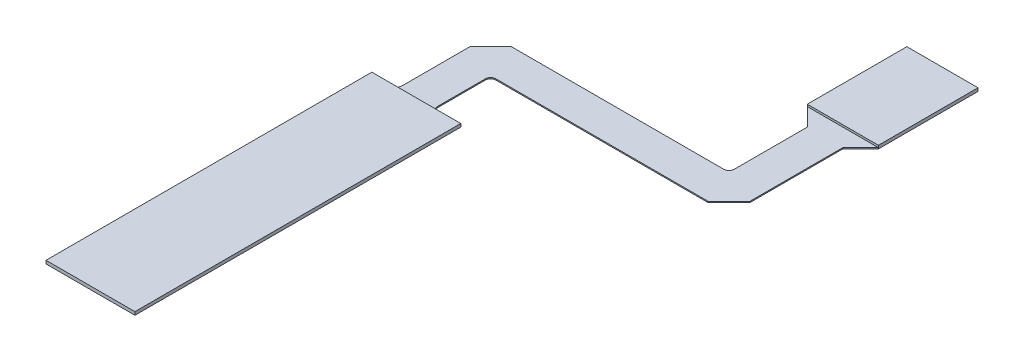
ISO-10303-21;
HEADER;
FILE_DESCRIPTION(('STEP AP214'),'2;1');
FILE_NAME('part.step','',(''),(''),'','','');
FILE_SCHEMA(('AUTOMOTIVE_DESIGN { 1 0 10303 214 1 1 1 1 }'));
ENDSEC;
DATA;
#1=APPLICATION_CONTEXT('core data for automotive mechanical design processes');
#2=APPLICATION_PROTOCOL_DEFINITION('international standard','automotive_design',2000,#1);
#3=PRODUCT_CONTEXT('',#1,'mechanical');
#4=PRODUCT('Part','Part','',(#3));
#5=PRODUCT_RELATED_PRODUCT_CATEGORY('part','',(#4));
#6=PRODUCT_DEFINITION_FORMATION('','',#4);
#7=PRODUCT_DEFINITION_CONTEXT('part definition',#1,'design');
#8=PRODUCT_DEFINITION('design','',#6,#7);
#9=PRODUCT_DEFINITION_SHAPE('','',#8);
#10=(LENGTH_UNIT() NAMED_UNIT(*) SI_UNIT(.MILLI.,.METRE.));
#11=(NAMED_UNIT(*) PLANE_ANGLE_UNIT() SI_UNIT($,.RADIAN.));
#12=(NAMED_UNIT(*) SI_UNIT($,.STERADIAN.) SOLID_ANGLE_UNIT());
#13=UNCERTAINTY_MEASURE_WITH_UNIT(LENGTH_MEASURE(1.E-05),#10,'distance_accuracy_value','');
#14=(GEOMETRIC_REPRESENTATION_CONTEXT(3) GLOBAL_UNCERTAINTY_ASSIGNED_CONTEXT((#13)) GLOBAL_UNIT_ASSIGNED_CONTEXT((#10,
#11,#12)) REPRESENTATION_CONTEXT('',''));
#15=CARTESIAN_POINT('',(0.,0.,0.));
#16=DIRECTION('',(0.,0.,1.));
#17=DIRECTION('',(1.,0.,0.));
#18=AXIS2_PLACEMENT_3D('',#15,#16,#17);
#19=CARTESIAN_POINT('',(4.50000000000001,-0.32,-217.13));
#20=DIRECTION('',(0.,0.,1.));
#21=DIRECTION('',(1.,0.,0.));
#22=AXIS2_PLACEMENT_3D('',#19,#20,#21);
#23=PLANE('',#22);
#24=DIRECTION('',(1.,0.,0.));
#25=VECTOR('',#24,1.);
#26=CARTESIAN_POINT('',(4.50000000000001,-0.32,-217.13));
#27=LINE('',#26,#25);
#28=CARTESIAN_POINT('',(6.,-0.32,-217.13));
#29=VERTEX_POINT('',#28);
#30=CARTESIAN_POINT('',(65.6421356237309,-0.320000000000015,-217.13));
#31=VERTEX_POINT('',#30);
#32=EDGE_CURVE('E62',#29,#31,#27,.T.);
#33=ORIENTED_EDGE('',*,*,#32,.T.);
#34=DIRECTION('',(0.,1.,0.));
#35=VECTOR('',#34,1.);
#36=CARTESIAN_POINT('',(65.6421356237309,-0.320000000000015,-217.13));
#37=LINE('',#36,#35);
#38=CARTESIAN_POINT('',(65.6421356237309,0.,-217.13));
#39=VERTEX_POINT('',#38);
#40=EDGE_CURVE('E259',#31,#39,#37,.T.);
#41=ORIENTED_EDGE('',*,*,#40,.T.);
#42=DIRECTION('',(1.,0.,0.));
#43=VECTOR('',#42,1.);
#44=CARTESIAN_POINT('',(4.50000000000001,0.,-217.13));
#45=LINE('',#44,#43);
#46=CARTESIAN_POINT('',(6.,0.,-217.13));
#47=VERTEX_POINT('',#46);
#48=EDGE_CURVE('E261',#47,#39,#45,.T.);
#49=ORIENTED_EDGE('',*,*,#48,.F.);
#50=DIRECTION('',(0.,1.,0.));
#51=VECTOR('',#50,1.);
#52=CARTESIAN_POINT('',(6.,-0.32,-217.13));
#53=LINE('',#52,#51);
#54=EDGE_CURVE('E222',#47,#29,#53,.F.);
#55=ORIENTED_EDGE('',*,*,#54,.T.);
#56=EDGE_LOOP('',(#33,#41,#49,#55));
#57=FACE_BOUND('',#56,.T.);
#58=ADVANCED_FACE('F53',(#57),#23,.T.);
#59=CARTESIAN_POINT('',(61.5,-0.320000000000001,-227.13));
#60=DIRECTION('',(0.,0.,-1.));
#61=DIRECTION('',(-1.,0.,0.));
#62=AXIS2_PLACEMENT_3D('',#59,#60,#61);
#63=PLANE('',#62);
#64=DIRECTION('',(-1.,0.,0.));
#65=VECTOR('',#64,1.);
#66=CARTESIAN_POINT('',(61.5,0.,-227.13));
#67=LINE('',#66,#65);
#68=CARTESIAN_POINT('',(60.,0.,-227.13));
#69=VERTEX_POINT('',#68);
#70=CARTESIAN_POINT('',(0.357864376269008,0.,-227.13));
#71=VERTEX_POINT('',#70);
#72=EDGE_CURVE('E344',#69,#71,#67,.T.);
#73=ORIENTED_EDGE('',*,*,#72,.F.);
#74=DIRECTION('',(0.,1.,0.));
#75=VECTOR('',#74,1.);
#76=CARTESIAN_POINT('',(60.,-0.319999999999997,-227.13));
#77=LINE('',#76,#75);
#78=CARTESIAN_POINT('',(60.,-0.319999999999997,-227.13));
#79=VERTEX_POINT('',#78);
#80=EDGE_CURVE('E280',#69,#79,#77,.F.);
#81=ORIENTED_EDGE('',*,*,#80,.T.);
#82=DIRECTION('',(-1.,0.,0.));
#83=VECTOR('',#82,1.);
#84=CARTESIAN_POINT('',(61.5,-0.320000000000001,-227.13));
#85=LINE('',#84,#83);
#86=CARTESIAN_POINT('',(0.357864376269015,-0.32,-227.13));
#87=VERTEX_POINT('',#86);
#88=EDGE_CURVE('E13',#79,#87,#85,.T.);
#89=ORIENTED_EDGE('',*,*,#88,.T.);
#90=DIRECTION('',(0.,1.,0.));
#91=VECTOR('',#90,1.);
#92=CARTESIAN_POINT('',(0.357864376269015,0.,-227.13));
#93=LINE('',#92,#91);
#94=EDGE_CURVE('E219',#71,#87,#93,.F.);
#95=ORIENTED_EDGE('',*,*,#94,.F.);
#96=EDGE_LOOP('',(#73,#81,#89,#95));
#97=FACE_BOUND('',#96,.T.);
#98=ADVANCED_FACE('F386',(#97),#63,.T.);
#99=CARTESIAN_POINT('',(-12.5,0.,-109.13));
#100=DIRECTION('',(0.,1.,0.));
#101=DIRECTION('',(0.,0.,1.));
#102=AXIS2_PLACEMENT_3D('',#99,#100,#101);
#103=PLANE('',#102);
#104=ORIENTED_EDGE('',*,*,#48,.T.);
#105=DIRECTION('',(0.707106781186548,0.,-0.707106781186547));
#106=VECTOR('',#105,1.);
#107=CARTESIAN_POINT('',(65.6421356237309,0.,-217.13));
#108=LINE('',#107,#106);
#109=CARTESIAN_POINT('',(71.5,0.,-222.987864376269));
#110=VERTEX_POINT('',#109);
#111=EDGE_CURVE('E265',#39,#110,#108,.T.);
#112=ORIENTED_EDGE('',*,*,#111,.T.);
#113=DIRECTION('',(0.,0.,-1.));
#114=VECTOR('',#113,1.);
#115=CARTESIAN_POINT('',(71.5,0.,-222.987864376269));
#116=LINE('',#115,#114);
#117=CARTESIAN_POINT('',(71.5,0.,-249.13));
#118=VERTEX_POINT('',#117);
#119=EDGE_CURVE('E262',#110,#118,#116,.T.);
#120=ORIENTED_EDGE('',*,*,#119,.T.);
#121=DIRECTION('',(0.707106781186549,0.,-0.707106781186546));
#122=VECTOR('',#121,1.);
#123=CARTESIAN_POINT('',(76.5,0.,-254.13));
#124=LINE('',#123,#122);
#125=CARTESIAN_POINT('',(76.5,0.,-254.13));
#126=VERTEX_POINT('',#125);
#127=EDGE_CURVE('E277',#118,#126,#124,.T.);
#128=ORIENTED_EDGE('',*,*,#127,.T.);
#129=DIRECTION('',(1.,0.,0.));
#130=VECTOR('',#129,1.);
#131=CARTESIAN_POINT('',(76.5,0.,-254.13));
#132=LINE('',#131,#130);
#133=CARTESIAN_POINT('',(56.5,0.,-254.13));
#134=VERTEX_POINT('',#133);
#135=EDGE_CURVE('E328',#134,#126,#132,.T.);
#136=ORIENTED_EDGE('',*,*,#135,.F.);
#137=DIRECTION('',(0.707106781186549,0.,0.707106781186546));
#138=VECTOR('',#137,1.);
#139=CARTESIAN_POINT('',(61.5,0.,-249.13));
#140=LINE('',#139,#138);
#141=CARTESIAN_POINT('',(61.5,0.,-249.13));
#142=VERTEX_POINT('',#141);
#143=EDGE_CURVE('E274',#134,#142,#140,.T.);
#144=ORIENTED_EDGE('',*,*,#143,.T.);
#145=DIRECTION('',(0.,0.,1.));
#146=VECTOR('',#145,1.);
#147=CARTESIAN_POINT('',(61.5,0.,-249.13));
#148=LINE('',#147,#146);
#149=CARTESIAN_POINT('',(61.5,0.,-228.63));
#150=VERTEX_POINT('',#149);
#151=EDGE_CURVE('E271',#142,#150,#148,.T.);
#152=ORIENTED_EDGE('',*,*,#151,.T.);
#153=CARTESIAN_POINT('',(60.,0.,-228.63));
#154=DIRECTION('',(0.,1.,0.));
#155=DIRECTION('',(0.,0.,1.));
#156=AXIS2_PLACEMENT_3D('',#153,#154,#155);
#157=CIRCLE('',#156,1.5);
#158=EDGE_CURVE('E268',#150,#69,#157,.F.);
#159=ORIENTED_EDGE('',*,*,#158,.T.);
#160=ORIENTED_EDGE('',*,*,#72,.T.);
#161=DIRECTION('',(0.707106781186543,0.,-0.707106781186552));
#162=VECTOR('',#161,1.);
#163=CARTESIAN_POINT('',(0.357864376269015,0.,-227.13));
#164=LINE('',#163,#162);
#165=CARTESIAN_POINT('',(-5.5,0.,-221.272135623731));
#166=VERTEX_POINT('',#165);
#167=EDGE_CURVE('E245',#166,#71,#164,.T.);
#168=ORIENTED_EDGE('',*,*,#167,.F.);
#169=DIRECTION('',(0.,0.,1.));
#170=VECTOR('',#169,1.);
#171=CARTESIAN_POINT('',(-5.5,0.,-227.13));
#172=LINE('',#171,#170);
#173=CARTESIAN_POINT('',(-5.49999999999999,0.,-202.23));
#174=VERTEX_POINT('',#173);
#175=EDGE_CURVE('E231',#166,#174,#172,.T.);
#176=ORIENTED_EDGE('',*,*,#175,.T.);
#177=CARTESIAN_POINT('',(-6.99999999999999,0.,-202.23));
#178=DIRECTION('',(0.,1.,0.));
#179=DIRECTION('',(0.,0.,1.));
#180=AXIS2_PLACEMENT_3D('',#177,#178,#179);
#181=CIRCLE('',#180,1.5);
#182=CARTESIAN_POINT('',(-6.99999999999999,0.,-200.73));
#183=VERTEX_POINT('',#182);
#184=EDGE_CURVE('E795',#174,#183,#181,.F.);
#185=ORIENTED_EDGE('',*,*,#184,.T.);
#186=DIRECTION('',(1.,0.,0.));
#187=VECTOR('',#186,1.);
#188=CARTESIAN_POINT('',(-12.5,0.,-200.73));
#189=LINE('',#188,#187);
#190=CARTESIAN_POINT('',(5.99999999999999,0.,-200.73));
#191=VERTEX_POINT('',#190);
#192=EDGE_CURVE('E793',#183,#191,#189,.T.);
#193=ORIENTED_EDGE('',*,*,#192,.T.);
#194=CARTESIAN_POINT('',(5.99999999999999,0.,-202.23));
#195=DIRECTION('',(0.,1.,0.));
#196=DIRECTION('',(0.,0.,1.));
#197=AXIS2_PLACEMENT_3D('',#194,#195,#196);
#198=CIRCLE('',#197,1.5);
#199=CARTESIAN_POINT('',(4.5,0.,-202.23));
#200=VERTEX_POINT('',#199);
#201=EDGE_CURVE('E791',#191,#200,#198,.F.);
#202=ORIENTED_EDGE('',*,*,#201,.T.);
#203=DIRECTION('',(0.,0.,-1.));
#204=VECTOR('',#203,1.);
#205=CARTESIAN_POINT('',(4.5,0.,-200.73));
#206=LINE('',#205,#204);
#207=CARTESIAN_POINT('',(4.5,0.,-215.63));
#208=VERTEX_POINT('',#207);
#209=EDGE_CURVE('E801',#200,#208,#206,.T.);
#210=ORIENTED_EDGE('',*,*,#209,.T.);
#211=CARTESIAN_POINT('',(6.,0.,-215.63));
#212=DIRECTION('',(0.,1.,0.));
#213=DIRECTION('',(0.,0.,1.));
#214=AXIS2_PLACEMENT_3D('',#211,#212,#213);
#215=CIRCLE('',#214,1.5);
#216=EDGE_CURVE('E350',#208,#47,#215,.F.);
#217=ORIENTED_EDGE('',*,*,#216,.T.);
#218=EDGE_LOOP('',(#104,#112,#120,#128,#136,#144,#152,#159,#160,#168,#176,#185,#193,#202,#210,#217));
#219=FACE_BOUND('',#218,.T.);
#220=ADVANCED_FACE('F347',(#219),#103,.T.);
#221=CARTESIAN_POINT('',(-12.5,-0.32,-109.13));
#222=DIRECTION('',(0.,1.,0.));
#223=DIRECTION('',(0.,0.,1.));
#224=AXIS2_PLACEMENT_3D('',#221,#222,#223);
#225=PLANE('',#224);
#226=ORIENTED_EDGE('',*,*,#88,.F.);
#227=CARTESIAN_POINT('',(60.,-0.319999999999997,-228.63));
#228=DIRECTION('',(0.,1.,0.));
#229=DIRECTION('',(0.,0.,1.));
#230=AXIS2_PLACEMENT_3D('',#227,#228,#229);
#231=CIRCLE('',#230,1.5);
#232=CARTESIAN_POINT('',(61.5,-0.320000000000004,-228.63));
#233=VERTEX_POINT('',#232);
#234=EDGE_CURVE('E282',#79,#233,#231,.T.);
#235=ORIENTED_EDGE('',*,*,#234,.T.);
#236=DIRECTION('',(0.,0.,1.));
#237=VECTOR('',#236,1.);
#238=CARTESIAN_POINT('',(61.5,-0.320000000000006,-249.13));
#239=LINE('',#238,#237);
#240=CARTESIAN_POINT('',(61.5,-0.320000000000006,-249.13));
#241=VERTEX_POINT('',#240);
#242=EDGE_CURVE('E287',#241,#233,#239,.T.);
#243=ORIENTED_EDGE('',*,*,#242,.F.);
#244=DIRECTION('',(0.707106781186549,0.,0.707106781186546));
#245=VECTOR('',#244,1.);
#246=CARTESIAN_POINT('',(61.5,-0.320000000000006,-249.13));
#247=LINE('',#246,#245);
#248=CARTESIAN_POINT('',(56.5,-0.320000000000004,-254.13));
#249=VERTEX_POINT('',#248);
#250=EDGE_CURVE('E293',#249,#241,#247,.T.);
#251=ORIENTED_EDGE('',*,*,#250,.F.);
#252=DIRECTION('',(0.,0.,1.));
#253=VECTOR('',#252,1.);
#254=CARTESIAN_POINT('',(56.5,-0.320000000000004,-254.13));
#255=LINE('',#254,#253);
#256=CARTESIAN_POINT('',(56.5,-0.320000000000009,-282.13));
#257=VERTEX_POINT('',#256);
#258=EDGE_CURVE('E296',#257,#249,#255,.T.);
#259=ORIENTED_EDGE('',*,*,#258,.F.);
#260=DIRECTION('',(-1.,0.,0.));
#261=VECTOR('',#260,1.);
#262=CARTESIAN_POINT('',(56.5,-0.320000000000009,-282.13));
#263=LINE('',#262,#261);
#264=CARTESIAN_POINT('',(76.5,-0.320000000000005,-282.13));
#265=VERTEX_POINT('',#264);
#266=EDGE_CURVE('E302',#265,#257,#263,.T.);
#267=ORIENTED_EDGE('',*,*,#266,.F.);
#268=DIRECTION('',(0.,0.,-1.));
#269=VECTOR('',#268,1.);
#270=CARTESIAN_POINT('',(76.5,-0.320000000000005,-282.13));
#271=LINE('',#270,#269);
#272=CARTESIAN_POINT('',(76.5,-0.320000000000004,-254.13));
#273=VERTEX_POINT('',#272);
#274=EDGE_CURVE('E307',#273,#265,#271,.T.);
#275=ORIENTED_EDGE('',*,*,#274,.F.);
#276=DIRECTION('',(0.707106781186549,0.,-0.707106781186546));
#277=VECTOR('',#276,1.);
#278=CARTESIAN_POINT('',(76.5,-0.320000000000004,-254.13));
#279=LINE('',#278,#277);
#280=CARTESIAN_POINT('',(71.5,-0.320000000000016,-249.13));
#281=VERTEX_POINT('',#280);
#282=EDGE_CURVE('E316',#281,#273,#279,.T.);
#283=ORIENTED_EDGE('',*,*,#282,.F.);
#284=DIRECTION('',(0.,0.,-1.));
#285=VECTOR('',#284,1.);
#286=CARTESIAN_POINT('',(71.5,-0.320000000000016,-222.987864376269));
#287=LINE('',#286,#285);
#288=CARTESIAN_POINT('',(71.5,-0.320000000000016,-222.987864376269));
#289=VERTEX_POINT('',#288);
#290=EDGE_CURVE('E321',#289,#281,#287,.T.);
#291=ORIENTED_EDGE('',*,*,#290,.F.);
#292=DIRECTION('',(0.707106781186548,0.,-0.707106781186547));
#293=VECTOR('',#292,1.);
#294=CARTESIAN_POINT('',(65.6421356237309,-0.320000000000015,-217.13));
#295=LINE('',#294,#293);
#296=EDGE_CURVE('E325',#31,#289,#295,.T.);
#297=ORIENTED_EDGE('',*,*,#296,.F.);
#298=ORIENTED_EDGE('',*,*,#32,.F.);
#299=CARTESIAN_POINT('',(6.,-0.32,-215.63));
#300=DIRECTION('',(0.,1.,0.));
#301=DIRECTION('',(0.,0.,1.));
#302=AXIS2_PLACEMENT_3D('',#299,#300,#301);
#303=CIRCLE('',#302,1.5);
#304=CARTESIAN_POINT('',(4.5,-0.32,-215.63));
#305=VERTEX_POINT('',#304);
#306=EDGE_CURVE('E733',#29,#305,#303,.T.);
#307=ORIENTED_EDGE('',*,*,#306,.T.);
#308=DIRECTION('',(0.,0.,-1.));
#309=VECTOR('',#308,1.);
#310=CARTESIAN_POINT('',(4.5,-0.32,-200.73));
#311=LINE('',#310,#309);
#312=CARTESIAN_POINT('',(4.5,-0.32,-202.23));
#313=VERTEX_POINT('',#312);
#314=EDGE_CURVE('E746',#313,#305,#311,.T.);
#315=ORIENTED_EDGE('',*,*,#314,.F.);
#316=CARTESIAN_POINT('',(5.99999999999999,-0.32,-202.23));
#317=DIRECTION('',(0.,1.,0.));
#318=DIRECTION('',(0.,0.,1.));
#319=AXIS2_PLACEMENT_3D('',#316,#317,#318);
#320=CIRCLE('',#319,1.5);
#321=CARTESIAN_POINT('',(5.99999999999999,-0.32,-200.73));
#322=VERTEX_POINT('',#321);
#323=EDGE_CURVE('E738',#313,#322,#320,.T.);
#324=ORIENTED_EDGE('',*,*,#323,.T.);
#325=DIRECTION('',(-1.,0.,0.));
#326=VECTOR('',#325,1.);
#327=CARTESIAN_POINT('',(-12.5,-0.32,-200.73));
#328=LINE('',#327,#326);
#329=CARTESIAN_POINT('',(12.5,-0.32,-200.73));
#330=VERTEX_POINT('',#329);
#331=EDGE_CURVE('E758',#330,#322,#328,.T.);
#332=ORIENTED_EDGE('',*,*,#331,.F.);
#333=DIRECTION('',(0.,0.,-1.));
#334=VECTOR('',#333,1.);
#335=CARTESIAN_POINT('',(12.5,-0.32,-200.73));
#336=LINE('',#335,#334);
#337=CARTESIAN_POINT('',(12.5,-0.32,-109.13));
#338=VERTEX_POINT('',#337);
#339=EDGE_CURVE('E764',#338,#330,#336,.T.);
#340=ORIENTED_EDGE('',*,*,#339,.F.);
#341=DIRECTION('',(1.,0.,0.));
#342=VECTOR('',#341,1.);
#343=CARTESIAN_POINT('',(-12.5,-0.32,-109.13));
#344=LINE('',#343,#342);
#345=CARTESIAN_POINT('',(-12.5,-0.32,-109.13));
#346=VERTEX_POINT('',#345);
#347=EDGE_CURVE('E769',#346,#338,#344,.T.);
#348=ORIENTED_EDGE('',*,*,#347,.F.);
#349=DIRECTION('',(0.,0.,1.));
#350=VECTOR('',#349,1.);
#351=CARTESIAN_POINT('',(-12.5,-0.32,-200.73));
#352=LINE('',#351,#350);
#353=CARTESIAN_POINT('',(-12.5,-0.32,-200.73));
#354=VERTEX_POINT('',#353);
#355=EDGE_CURVE('E774',#354,#346,#352,.T.);
#356=ORIENTED_EDGE('',*,*,#355,.F.);
#357=CARTESIAN_POINT('',(-6.99999999999999,-0.32,-200.73));
#358=VERTEX_POINT('',#357);
#359=EDGE_CURVE('E748',#358,#354,#328,.T.);
#360=ORIENTED_EDGE('',*,*,#359,.F.);
#361=CARTESIAN_POINT('',(-6.99999999999999,-0.32,-202.23));
#362=DIRECTION('',(0.,1.,0.));
#363=DIRECTION('',(0.,0.,1.));
#364=AXIS2_PLACEMENT_3D('',#361,#362,#363);
#365=CIRCLE('',#364,1.5);
#366=CARTESIAN_POINT('',(-5.49999999999999,-0.32,-202.23));
#367=VERTEX_POINT('',#366);
#368=EDGE_CURVE('E223',#358,#367,#365,.T.);
#369=ORIENTED_EDGE('',*,*,#368,.T.);
#370=DIRECTION('',(0.,0.,1.));
#371=VECTOR('',#370,1.);
#372=CARTESIAN_POINT('',(-5.5,-0.32,-227.13));
#373=LINE('',#372,#371);
#374=CARTESIAN_POINT('',(-5.5,-0.32,-221.272135623731));
#375=VERTEX_POINT('',#374);
#376=EDGE_CURVE('E229',#375,#367,#373,.T.);
#377=ORIENTED_EDGE('',*,*,#376,.F.);
#378=DIRECTION('',(0.707106781186543,0.,-0.707106781186552));
#379=VECTOR('',#378,1.);
#380=CARTESIAN_POINT('',(0.357864376269015,-0.32,-227.13));
#381=LINE('',#380,#379);
#382=EDGE_CURVE('E217',#375,#87,#381,.T.);
#383=ORIENTED_EDGE('',*,*,#382,.T.);
#384=EDGE_LOOP('',(#226,#235,#243,#251,#259,#267,#275,#283,#291,#297,#298,#307,#315,#324,#332,
#340,#348,#356,#360,#369,#377,#383));
#385=FACE_BOUND('',#384,.T.);
#386=ADVANCED_FACE('F55',(#385),#225,.F.);
#387=CARTESIAN_POINT('',(-12.5,0.579999999999992,-109.13));
#388=DIRECTION('',(0.,1.,0.));
#389=DIRECTION('',(0.,0.,1.));
#390=AXIS2_PLACEMENT_3D('',#387,#388,#389);
#391=PLANE('',#390);
#392=DIRECTION('',(1.,0.,0.));
#393=VECTOR('',#392,1.);
#394=CARTESIAN_POINT('',(76.5,0.579999999999987,-254.13));
#395=LINE('',#394,#393);
#396=CARTESIAN_POINT('',(56.5,0.579999999999994,-254.13));
#397=VERTEX_POINT('',#396);
#398=CARTESIAN_POINT('',(76.5,0.579999999999987,-254.13));
#399=VERTEX_POINT('',#398);
#400=EDGE_CURVE('E340',#397,#399,#395,.T.);
#401=ORIENTED_EDGE('',*,*,#400,.T.);
#402=DIRECTION('',(0.,0.,-1.));
#403=VECTOR('',#402,1.);
#404=CARTESIAN_POINT('',(76.5,0.579999999999987,-254.13));
#405=LINE('',#404,#403);
#406=CARTESIAN_POINT('',(76.5,0.579999999999986,-282.13));
#407=VERTEX_POINT('',#406);
#408=EDGE_CURVE('E337',#399,#407,#405,.T.);
#409=ORIENTED_EDGE('',*,*,#408,.T.);
#410=DIRECTION('',(-1.,0.,0.));
#411=VECTOR('',#410,1.);
#412=CARTESIAN_POINT('',(76.5,0.579999999999986,-282.13));
#413=LINE('',#412,#411);
#414=CARTESIAN_POINT('',(56.5,0.579999999999996,-282.13));
#415=VERTEX_POINT('',#414);
#416=EDGE_CURVE('E334',#407,#415,#413,.T.);
#417=ORIENTED_EDGE('',*,*,#416,.T.);
#418=DIRECTION('',(0.,0.,1.));
#419=VECTOR('',#418,1.);
#420=CARTESIAN_POINT('',(56.5,0.579999999999997,-254.13));
#421=LINE('',#420,#419);
#422=EDGE_CURVE('E331',#415,#397,#421,.T.);
#423=ORIENTED_EDGE('',*,*,#422,.T.);
#424=EDGE_LOOP('',(#401,#409,#417,#423));
#425=FACE_BOUND('',#424,.T.);
#426=ADVANCED_FACE('F375',(#425),#391,.T.);
#427=CARTESIAN_POINT('',(76.5,35.8893010681705,-254.13));
#428=DIRECTION('',(0.,0.,-1.));
#429=DIRECTION('',(-0.484809620246332,-0.874619707139399,0.));
#430=AXIS2_PLACEMENT_3D('',#427,#428,#429);
#431=PLANE('',#430);
#432=ORIENTED_EDGE('',*,*,#400,.F.);
#433=DIRECTION('',(0.,-1.,0.));
#434=VECTOR('',#433,1.);
#435=CARTESIAN_POINT('',(56.5,35.8893010681705,-254.13));
#436=LINE('',#435,#434);
#437=EDGE_CURVE('E139',#397,#134,#436,.T.);
#438=ORIENTED_EDGE('',*,*,#437,.T.);
#439=ORIENTED_EDGE('',*,*,#135,.T.);
#440=DIRECTION('',(0.,-1.,0.));
#441=VECTOR('',#440,1.);
#442=CARTESIAN_POINT('',(76.5,35.8893010681705,-254.13));
#443=LINE('',#442,#441);
#444=EDGE_CURVE('E135',#399,#126,#443,.T.);
#445=ORIENTED_EDGE('',*,*,#444,.F.);
#446=EDGE_LOOP('',(#432,#438,#439,#445));
#447=FACE_BOUND('',#446,.T.);
#448=ADVANCED_FACE('F376',(#447),#431,.F.);
#449=CARTESIAN_POINT('',(65.6421356237309,-0.320000000000015,-217.13));
#450=DIRECTION('',(0.707106781186548,0.,0.707106781186547));
#451=DIRECTION('',(0.707106781186548,0.,-0.707106781186548));
#452=AXIS2_PLACEMENT_3D('',#449,#450,#451);
#453=PLANE('',#452);
#454=ORIENTED_EDGE('',*,*,#111,.F.);
#455=ORIENTED_EDGE('',*,*,#40,.F.);
#456=ORIENTED_EDGE('',*,*,#296,.T.);
#457=DIRECTION('',(0.,1.,0.));
#458=VECTOR('',#457,1.);
#459=CARTESIAN_POINT('',(71.5,-0.320000000000016,-222.987864376269));
#460=LINE('',#459,#458);
#461=EDGE_CURVE('E323',#289,#110,#460,.T.);
#462=ORIENTED_EDGE('',*,*,#461,.T.);
#463=EDGE_LOOP('',(#454,#455,#456,#462));
#464=FACE_BOUND('',#463,.T.);
#465=ADVANCED_FACE('F354',(#464),#453,.T.);
#466=CARTESIAN_POINT('',(71.5,-0.320000000000016,-222.987864376269));
#467=DIRECTION('',(1.,0.,0.));
#468=DIRECTION('',(0.,0.,-1.));
#469=AXIS2_PLACEMENT_3D('',#466,#467,#468);
#470=PLANE('',#469);
#471=ORIENTED_EDGE('',*,*,#119,.F.);
#472=ORIENTED_EDGE('',*,*,#461,.F.);
#473=ORIENTED_EDGE('',*,*,#290,.T.);
#474=DIRECTION('',(0.,1.,0.));
#475=VECTOR('',#474,1.);
#476=CARTESIAN_POINT('',(71.5,-0.320000000000016,-249.13));
#477=LINE('',#476,#475);
#478=EDGE_CURVE('E319',#281,#118,#477,.T.);
#479=ORIENTED_EDGE('',*,*,#478,.T.);
#480=EDGE_LOOP('',(#471,#472,#473,#479));
#481=FACE_BOUND('',#480,.T.);
#482=ADVANCED_FACE('F358',(#481),#470,.T.);
#483=CARTESIAN_POINT('',(76.5,-0.320000000000004,-254.13));
#484=DIRECTION('',(0.707106781186546,0.,0.707106781186549));
#485=DIRECTION('',(0.707106781186549,0.,-0.707106781186546));
#486=AXIS2_PLACEMENT_3D('',#483,#484,#485);
#487=PLANE('',#486);
#488=ORIENTED_EDGE('',*,*,#127,.F.);
#489=ORIENTED_EDGE('',*,*,#478,.F.);
#490=ORIENTED_EDGE('',*,*,#282,.T.);
#491=DIRECTION('',(0.,1.,0.));
#492=VECTOR('',#491,1.);
#493=CARTESIAN_POINT('',(76.5,-0.320000000000004,-254.13));
#494=LINE('',#493,#492);
#495=EDGE_CURVE('E313',#273,#126,#494,.T.);
#496=ORIENTED_EDGE('',*,*,#495,.T.);
#497=EDGE_LOOP('',(#488,#489,#490,#496));
#498=FACE_BOUND('',#497,.T.);
#499=ADVANCED_FACE('F362',(#498),#487,.T.);
#500=CARTESIAN_POINT('',(76.5,-0.320000000000005,-282.13));
#501=DIRECTION('',(1.,0.,0.));
#502=DIRECTION('',(0.,0.,-1.));
#503=AXIS2_PLACEMENT_3D('',#500,#501,#502);
#504=PLANE('',#503);
#505=DIRECTION('',(0.,1.,0.));
#506=VECTOR('',#505,1.);
#507=CARTESIAN_POINT('',(76.5,-0.320000000000005,-282.13));
#508=LINE('',#507,#506);
#509=EDGE_CURVE('E311',#265,#407,#508,.T.);
#510=ORIENTED_EDGE('',*,*,#509,.T.);
#511=ORIENTED_EDGE('',*,*,#408,.F.);
#512=ORIENTED_EDGE('',*,*,#444,.T.);
#513=ORIENTED_EDGE('',*,*,#495,.F.);
#514=ORIENTED_EDGE('',*,*,#274,.T.);
#515=EDGE_LOOP('',(#510,#511,#512,#513,#514));
#516=FACE_BOUND('',#515,.T.);
#517=ADVANCED_FACE('F366',(#516),#504,.T.);
#518=CARTESIAN_POINT('',(56.5,-0.320000000000009,-282.13));
#519=DIRECTION('',(0.,0.,-1.));
#520=DIRECTION('',(-1.,0.,0.));
#521=AXIS2_PLACEMENT_3D('',#518,#519,#520);
#522=PLANE('',#521);
#523=DIRECTION('',(0.,1.,0.));
#524=VECTOR('',#523,1.);
#525=CARTESIAN_POINT('',(56.5,-0.320000000000009,-282.13));
#526=LINE('',#525,#524);
#527=EDGE_CURVE('E305',#257,#415,#526,.T.);
#528=ORIENTED_EDGE('',*,*,#527,.T.);
#529=ORIENTED_EDGE('',*,*,#416,.F.);
#530=ORIENTED_EDGE('',*,*,#509,.F.);
#531=ORIENTED_EDGE('',*,*,#266,.T.);
#532=EDGE_LOOP('',(#528,#529,#530,#531));
#533=FACE_BOUND('',#532,.T.);
#534=ADVANCED_FACE('F371',(#533),#522,.T.);
#535=CARTESIAN_POINT('',(56.5,-0.320000000000004,-254.13));
#536=DIRECTION('',(-1.,0.,0.));
#537=DIRECTION('',(0.,0.,1.));
#538=AXIS2_PLACEMENT_3D('',#535,#536,#537);
#539=PLANE('',#538);
#540=DIRECTION('',(0.,1.,0.));
#541=VECTOR('',#540,1.);
#542=CARTESIAN_POINT('',(56.5,-0.320000000000004,-254.13));
#543=LINE('',#542,#541);
#544=EDGE_CURVE('E299',#249,#134,#543,.T.);
#545=ORIENTED_EDGE('',*,*,#544,.T.);
#546=ORIENTED_EDGE('',*,*,#437,.F.);
#547=ORIENTED_EDGE('',*,*,#422,.F.);
#548=ORIENTED_EDGE('',*,*,#527,.F.);
#549=ORIENTED_EDGE('',*,*,#258,.T.);
#550=EDGE_LOOP('',(#545,#546,#547,#548,#549));
#551=FACE_BOUND('',#550,.T.);
#552=ADVANCED_FACE('F406',(#551),#539,.T.);
#553=CARTESIAN_POINT('',(61.5,-0.320000000000006,-249.13));
#554=DIRECTION('',(-0.707106781186546,0.,0.707106781186549));
#555=DIRECTION('',(0.707106781186549,0.,0.707106781186546));
#556=AXIS2_PLACEMENT_3D('',#553,#554,#555);
#557=PLANE('',#556);
#558=ORIENTED_EDGE('',*,*,#143,.F.);
#559=ORIENTED_EDGE('',*,*,#544,.F.);
#560=ORIENTED_EDGE('',*,*,#250,.T.);
#561=DIRECTION('',(0.,1.,0.));
#562=VECTOR('',#561,1.);
#563=CARTESIAN_POINT('',(61.5,-0.320000000000006,-249.13));
#564=LINE('',#563,#562);
#565=EDGE_CURVE('E290',#241,#142,#564,.T.);
#566=ORIENTED_EDGE('',*,*,#565,.T.);
#567=EDGE_LOOP('',(#558,#559,#560,#566));
#568=FACE_BOUND('',#567,.T.);
#569=ADVANCED_FACE('F402',(#568),#557,.T.);
#570=CARTESIAN_POINT('',(61.5,-0.320000000000006,-249.13));
#571=DIRECTION('',(-1.,0.,0.));
#572=DIRECTION('',(0.,0.,1.));
#573=AXIS2_PLACEMENT_3D('',#570,#571,#572);
#574=PLANE('',#573);
#575=ORIENTED_EDGE('',*,*,#242,.T.);
#576=DIRECTION('',(0.,1.,0.));
#577=VECTOR('',#576,1.);
#578=CARTESIAN_POINT('',(61.5,0.,-228.63));
#579=LINE('',#578,#577);
#580=EDGE_CURVE('E284',#233,#150,#579,.T.);
#581=ORIENTED_EDGE('',*,*,#580,.T.);
#582=ORIENTED_EDGE('',*,*,#151,.F.);
#583=ORIENTED_EDGE('',*,*,#565,.F.);
#584=EDGE_LOOP('',(#575,#581,#582,#583));
#585=FACE_BOUND('',#584,.T.);
#586=ADVANCED_FACE('F398',(#585),#574,.T.);
#587=CARTESIAN_POINT('',(60.,-0.319999999999997,-228.63));
#588=DIRECTION('',(0.,-1.,0.));
#589=DIRECTION('',(0.,0.,-1.));
#590=AXIS2_PLACEMENT_3D('',#587,#588,#589);
#591=CYLINDRICAL_SURFACE('',#590,1.5);
#592=ORIENTED_EDGE('',*,*,#234,.F.);
#593=ORIENTED_EDGE('',*,*,#80,.F.);
#594=ORIENTED_EDGE('',*,*,#158,.F.);
#595=ORIENTED_EDGE('',*,*,#580,.F.);
#596=EDGE_LOOP('',(#592,#593,#594,#595));
#597=FACE_BOUND('',#596,.T.);
#598=ADVANCED_FACE('F394',(#597),#591,.F.);
#599=CARTESIAN_POINT('',(-12.5,0.58,-109.13));
#600=DIRECTION('',(0.,1.,0.));
#601=DIRECTION('',(0.,0.,1.));
#602=AXIS2_PLACEMENT_3D('',#599,#600,#601);
#603=PLANE('',#602);
#604=DIRECTION('',(0.,0.,-1.));
#605=VECTOR('',#604,1.);
#606=CARTESIAN_POINT('',(12.5,0.579999999999997,-200.73));
#607=LINE('',#606,#605);
#608=CARTESIAN_POINT('',(12.5,0.579999999999997,-109.13));
#609=VERTEX_POINT('',#608);
#610=CARTESIAN_POINT('',(12.5,0.579999999999997,-200.73));
#611=VERTEX_POINT('',#610);
#612=EDGE_CURVE('E256',#609,#611,#607,.T.);
#613=ORIENTED_EDGE('',*,*,#612,.T.);
#614=DIRECTION('',(-1.,0.,0.));
#615=VECTOR('',#614,1.);
#616=CARTESIAN_POINT('',(12.5,0.579999999999997,-200.73));
#617=LINE('',#616,#615);
#618=CARTESIAN_POINT('',(-12.5,0.579999999999997,-200.73));
#619=VERTEX_POINT('',#618);
#620=EDGE_CURVE('E253',#611,#619,#617,.T.);
#621=ORIENTED_EDGE('',*,*,#620,.T.);
#622=DIRECTION('',(0.,0.,1.));
#623=VECTOR('',#622,1.);
#624=CARTESIAN_POINT('',(-12.5,0.579999999999997,-200.73));
#625=LINE('',#624,#623);
#626=CARTESIAN_POINT('',(-12.5,0.579999999999997,-109.13));
#627=VERTEX_POINT('',#626);
#628=EDGE_CURVE('E250',#619,#627,#625,.T.);
#629=ORIENTED_EDGE('',*,*,#628,.T.);
#630=DIRECTION('',(1.,0.,0.));
#631=VECTOR('',#630,1.);
#632=CARTESIAN_POINT('',(12.5,0.579999999999997,-109.13));
#633=LINE('',#632,#631);
#634=EDGE_CURVE('E247',#627,#609,#633,.T.);
#635=ORIENTED_EDGE('',*,*,#634,.T.);
#636=EDGE_LOOP('',(#613,#621,#629,#635));
#637=FACE_BOUND('',#636,.T.);
#638=ADVANCED_FACE('F397',(#637),#603,.T.);
#639=CARTESIAN_POINT('',(0.357864376269015,0.,-227.13));
#640=DIRECTION('',(0.707106781186552,0.,0.707106781186543));
#641=DIRECTION('',(0.707106781186543,0.,-0.707106781186552));
#642=AXIS2_PLACEMENT_3D('',#639,#640,#641);
#643=PLANE('',#642);
#644=ORIENTED_EDGE('',*,*,#167,.T.);
#645=ORIENTED_EDGE('',*,*,#94,.T.);
#646=ORIENTED_EDGE('',*,*,#382,.F.);
#647=DIRECTION('',(0.,1.,0.));
#648=VECTOR('',#647,1.);
#649=CARTESIAN_POINT('',(-5.5,0.,-221.272135623731));
#650=LINE('',#649,#648);
#651=EDGE_CURVE('E214',#166,#375,#650,.F.);
#652=ORIENTED_EDGE('',*,*,#651,.F.);
#653=EDGE_LOOP('',(#644,#645,#646,#652));
#654=FACE_BOUND('',#653,.T.);
#655=ADVANCED_FACE('F218',(#654),#643,.F.);
#656=CARTESIAN_POINT('',(-5.5,-0.32,-227.13));
#657=DIRECTION('',(-1.,0.,0.));
#658=DIRECTION('',(0.,0.,1.));
#659=AXIS2_PLACEMENT_3D('',#656,#657,#658);
#660=PLANE('',#659);
#661=ORIENTED_EDGE('',*,*,#175,.F.);
#662=ORIENTED_EDGE('',*,*,#651,.T.);
#663=ORIENTED_EDGE('',*,*,#376,.T.);
#664=DIRECTION('',(0.,1.,0.));
#665=VECTOR('',#664,1.);
#666=CARTESIAN_POINT('',(-5.49999999999999,0.,-202.23));
#667=LINE('',#666,#665);
#668=EDGE_CURVE('E236',#367,#174,#667,.T.);
#669=ORIENTED_EDGE('',*,*,#668,.T.);
#670=EDGE_LOOP('',(#661,#662,#663,#669));
#671=FACE_BOUND('',#670,.T.);
#672=ADVANCED_FACE('F227',(#671),#660,.T.);
#673=CARTESIAN_POINT('',(-6.99999999999999,-0.32,-202.23));
#674=DIRECTION('',(0.,-1.,0.));
#675=DIRECTION('',(0.,0.,-1.));
#676=AXIS2_PLACEMENT_3D('',#673,#674,#675);
#677=CYLINDRICAL_SURFACE('',#676,1.5);
#678=ORIENTED_EDGE('',*,*,#368,.F.);
#679=DIRECTION('',(0.,1.,0.));
#680=VECTOR('',#679,1.);
#681=CARTESIAN_POINT('',(-6.99999999999999,-0.32,-200.73));
#682=LINE('',#681,#680);
#683=EDGE_CURVE('E752',#183,#358,#682,.F.);
#684=ORIENTED_EDGE('',*,*,#683,.F.);
#685=ORIENTED_EDGE('',*,*,#184,.F.);
#686=ORIENTED_EDGE('',*,*,#668,.F.);
#687=EDGE_LOOP('',(#678,#684,#685,#686));
#688=FACE_BOUND('',#687,.T.);
#689=ADVANCED_FACE('F469',(#688),#677,.F.);
#690=CARTESIAN_POINT('',(-12.5,-0.32,-200.73));
#691=DIRECTION('',(-1.,0.,0.));
#692=DIRECTION('',(0.,0.,1.));
#693=AXIS2_PLACEMENT_3D('',#690,#691,#692);
#694=PLANE('',#693);
#695=DIRECTION('',(0.,1.,0.));
#696=VECTOR('',#695,1.);
#697=CARTESIAN_POINT('',(-12.5,-0.32,-109.13));
#698=LINE('',#697,#696);
#699=EDGE_CURVE('E238',#346,#627,#698,.T.);
#700=ORIENTED_EDGE('',*,*,#699,.T.);
#701=ORIENTED_EDGE('',*,*,#628,.F.);
#702=DIRECTION('',(0.,1.,0.));
#703=VECTOR('',#702,1.);
#704=CARTESIAN_POINT('',(-12.5,-0.32,-200.73));
#705=LINE('',#704,#703);
#706=EDGE_CURVE('E762',#354,#619,#705,.T.);
#707=ORIENTED_EDGE('',*,*,#706,.F.);
#708=ORIENTED_EDGE('',*,*,#355,.T.);
#709=EDGE_LOOP('',(#700,#701,#707,#708));
#710=FACE_BOUND('',#709,.T.);
#711=ADVANCED_FACE('F476',(#710),#694,.T.);
#712=CARTESIAN_POINT('',(-12.5,-0.32,-109.13));
#713=DIRECTION('',(0.,0.,1.));
#714=DIRECTION('',(1.,0.,0.));
#715=AXIS2_PLACEMENT_3D('',#712,#713,#714);
#716=PLANE('',#715);
#717=DIRECTION('',(0.,1.,0.));
#718=VECTOR('',#717,1.);
#719=CARTESIAN_POINT('',(12.5,-0.32,-109.13));
#720=LINE('',#719,#718);
#721=EDGE_CURVE('E772',#338,#609,#720,.T.);
#722=ORIENTED_EDGE('',*,*,#721,.T.);
#723=ORIENTED_EDGE('',*,*,#634,.F.);
#724=ORIENTED_EDGE('',*,*,#699,.F.);
#725=ORIENTED_EDGE('',*,*,#347,.T.);
#726=EDGE_LOOP('',(#722,#723,#724,#725));
#727=FACE_BOUND('',#726,.T.);
#728=ADVANCED_FACE('F484',(#727),#716,.T.);
#729=CARTESIAN_POINT('',(12.5,-0.32,-200.73));
#730=DIRECTION('',(1.,0.,0.));
#731=DIRECTION('',(0.,0.,-1.));
#732=AXIS2_PLACEMENT_3D('',#729,#730,#731);
#733=PLANE('',#732);
#734=DIRECTION('',(0.,1.,0.));
#735=VECTOR('',#734,1.);
#736=CARTESIAN_POINT('',(12.5,-0.32,-200.73));
#737=LINE('',#736,#735);
#738=EDGE_CURVE('E767',#330,#611,#737,.T.);
#739=ORIENTED_EDGE('',*,*,#738,.T.);
#740=ORIENTED_EDGE('',*,*,#612,.F.);
#741=ORIENTED_EDGE('',*,*,#721,.F.);
#742=ORIENTED_EDGE('',*,*,#339,.T.);
#743=EDGE_LOOP('',(#739,#740,#741,#742));
#744=FACE_BOUND('',#743,.T.);
#745=ADVANCED_FACE('F492',(#744),#733,.T.);
#746=CARTESIAN_POINT('',(-12.5,-0.32,-200.73));
#747=DIRECTION('',(0.,0.,-1.));
#748=DIRECTION('',(-1.,0.,0.));
#749=AXIS2_PLACEMENT_3D('',#746,#747,#748);
#750=PLANE('',#749);
#751=ORIENTED_EDGE('',*,*,#706,.T.);
#752=ORIENTED_EDGE('',*,*,#620,.F.);
#753=ORIENTED_EDGE('',*,*,#738,.F.);
#754=ORIENTED_EDGE('',*,*,#331,.T.);
#755=DIRECTION('',(0.,1.,0.));
#756=VECTOR('',#755,1.);
#757=CARTESIAN_POINT('',(5.99999999999999,0.,-200.73));
#758=LINE('',#757,#756);
#759=EDGE_CURVE('E761',#322,#191,#758,.T.);
#760=ORIENTED_EDGE('',*,*,#759,.T.);
#761=ORIENTED_EDGE('',*,*,#192,.F.);
#762=ORIENTED_EDGE('',*,*,#683,.T.);
#763=ORIENTED_EDGE('',*,*,#359,.T.);
#764=EDGE_LOOP('',(#751,#752,#753,#754,#760,#761,#762,#763));
#765=FACE_BOUND('',#764,.T.);
#766=ADVANCED_FACE('F500',(#765),#750,.T.);
#767=CARTESIAN_POINT('',(5.99999999999999,-0.32,-202.23));
#768=DIRECTION('',(0.,-1.,0.));
#769=DIRECTION('',(0.,0.,-1.));
#770=AXIS2_PLACEMENT_3D('',#767,#768,#769);
#771=CYLINDRICAL_SURFACE('',#770,1.5);
#772=ORIENTED_EDGE('',*,*,#323,.F.);
#773=DIRECTION('',(0.,1.,0.));
#774=VECTOR('',#773,1.);
#775=CARTESIAN_POINT('',(4.5,-0.32,-202.23));
#776=LINE('',#775,#774);
#777=EDGE_CURVE('E739',#200,#313,#776,.F.);
#778=ORIENTED_EDGE('',*,*,#777,.F.);
#779=ORIENTED_EDGE('',*,*,#201,.F.);
#780=ORIENTED_EDGE('',*,*,#759,.F.);
#781=EDGE_LOOP('',(#772,#778,#779,#780));
#782=FACE_BOUND('',#781,.T.);
#783=ADVANCED_FACE('F508',(#782),#771,.F.);
#784=CARTESIAN_POINT('',(4.5,-0.32,-200.73));
#785=DIRECTION('',(1.,0.,0.));
#786=DIRECTION('',(0.,0.,-1.));
#787=AXIS2_PLACEMENT_3D('',#784,#785,#786);
#788=PLANE('',#787);
#789=ORIENTED_EDGE('',*,*,#314,.T.);
#790=DIRECTION('',(0.,1.,0.));
#791=VECTOR('',#790,1.);
#792=CARTESIAN_POINT('',(4.5,0.,-215.63));
#793=LINE('',#792,#791);
#794=EDGE_CURVE('E735',#305,#208,#793,.T.);
#795=ORIENTED_EDGE('',*,*,#794,.T.);
#796=ORIENTED_EDGE('',*,*,#209,.F.);
#797=ORIENTED_EDGE('',*,*,#777,.T.);
#798=EDGE_LOOP('',(#789,#795,#796,#797));
#799=FACE_BOUND('',#798,.T.);
#800=ADVANCED_FACE('F516',(#799),#788,.T.);
#801=CARTESIAN_POINT('',(6.,-0.32,-215.63));
#802=DIRECTION('',(0.,-1.,0.));
#803=DIRECTION('',(0.,0.,-1.));
#804=AXIS2_PLACEMENT_3D('',#801,#802,#803);
#805=CYLINDRICAL_SURFACE('',#804,1.5);
#806=ORIENTED_EDGE('',*,*,#306,.F.);
#807=ORIENTED_EDGE('',*,*,#54,.F.);
#808=ORIENTED_EDGE('',*,*,#216,.F.);
#809=ORIENTED_EDGE('',*,*,#794,.F.);
#810=EDGE_LOOP('',(#806,#807,#808,#809));
#811=FACE_BOUND('',#810,.T.);
#812=ADVANCED_FACE('F524',(#811),#805,.F.);
#813=CLOSED_SHELL('',(#58,#98,#220,#386,#426,#448,#465,#482,#499,#517,#534,#552,#569,#586,#598,
#638,#655,#672,#689,#711,#728,#745,#766,#783,#800,#812));
#814=MANIFOLD_SOLID_BREP('B2',#813);
#815=ADVANCED_BREP_SHAPE_REPRESENTATION('',(#18,#814),#14);
#816=SHAPE_DEFINITION_REPRESENTATION(#9,#815);
ENDSEC;
END-ISO-10303-21;
